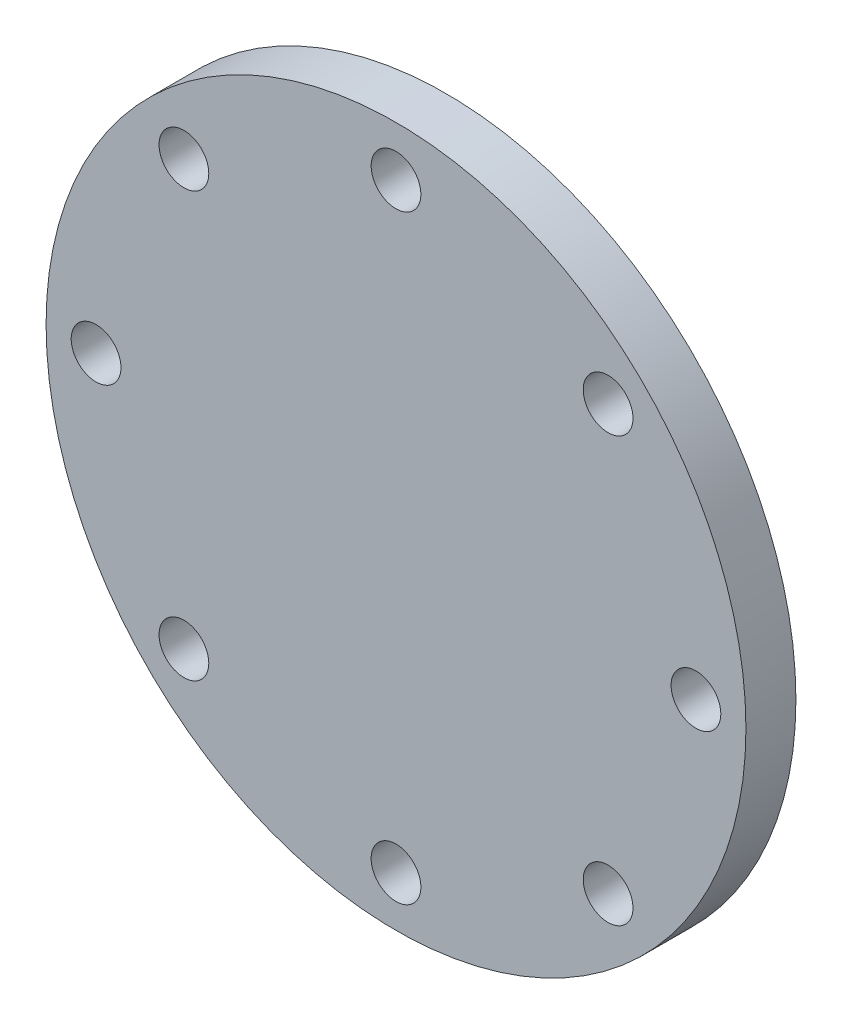
ISO-10303-21;
HEADER;
FILE_DESCRIPTION(('STEP AP214'),'2;1');
FILE_NAME('part.step','',(''),(''),'','','');
FILE_SCHEMA(('AUTOMOTIVE_DESIGN { 1 0 10303 214 1 1 1 1 }'));
ENDSEC;
DATA;
#1=APPLICATION_CONTEXT('core data for automotive mechanical design processes');
#2=APPLICATION_PROTOCOL_DEFINITION('international standard','automotive_design',2000,#1);
#3=PRODUCT_CONTEXT('',#1,'mechanical');
#4=PRODUCT('Part','Part','',(#3));
#5=PRODUCT_RELATED_PRODUCT_CATEGORY('part','',(#4));
#6=PRODUCT_DEFINITION_FORMATION('','',#4);
#7=PRODUCT_DEFINITION_CONTEXT('part definition',#1,'design');
#8=PRODUCT_DEFINITION('design','',#6,#7);
#9=PRODUCT_DEFINITION_SHAPE('','',#8);
#10=(LENGTH_UNIT() NAMED_UNIT(*) SI_UNIT(.MILLI.,.METRE.));
#11=(NAMED_UNIT(*) PLANE_ANGLE_UNIT() SI_UNIT($,.RADIAN.));
#12=(NAMED_UNIT(*) SI_UNIT($,.STERADIAN.) SOLID_ANGLE_UNIT());
#13=UNCERTAINTY_MEASURE_WITH_UNIT(LENGTH_MEASURE(1.E-05),#10,'distance_accuracy_value','');
#14=(GEOMETRIC_REPRESENTATION_CONTEXT(3) GLOBAL_UNCERTAINTY_ASSIGNED_CONTEXT((#13)) GLOBAL_UNIT_ASSIGNED_CONTEXT((#10,
#11,#12)) REPRESENTATION_CONTEXT('',''));
#15=CARTESIAN_POINT('',(0.,0.,0.));
#16=DIRECTION('',(0.,0.,1.));
#17=DIRECTION('',(1.,0.,0.));
#18=AXIS2_PLACEMENT_3D('',#15,#16,#17);
#19=CARTESIAN_POINT('',(0.,0.,0.));
#20=DIRECTION('',(0.,0.,1.));
#21=DIRECTION('',(1.,0.,0.));
#22=AXIS2_PLACEMENT_3D('',#19,#20,#21);
#23=PLANE('',#22);
#24=CARTESIAN_POINT('',(0.,0.,0.));
#25=DIRECTION('',(0.,0.,1.));
#26=DIRECTION('',(1.,0.,0.));
#27=AXIS2_PLACEMENT_3D('',#24,#25,#26);
#28=CIRCLE('',#27,17.78);
#29=CARTESIAN_POINT('',(17.78,0.,0.));
#30=VERTEX_POINT('',#29);
#31=EDGE_CURVE('E42',#30,#30,#28,.T.);
#32=ORIENTED_EDGE('',*,*,#31,.F.);
#33=EDGE_LOOP('',(#32));
#34=FACE_BOUND('',#33,.T.);
#35=CARTESIAN_POINT('',(0.,15.24,0.));
#36=DIRECTION('',(0.,0.,1.));
#37=DIRECTION('',(1.,0.,0.));
#38=AXIS2_PLACEMENT_3D('',#35,#36,#37);
#39=CIRCLE('',#38,1.26364999999999);
#40=CARTESIAN_POINT('',(1.26364999999999,15.24,0.));
#41=VERTEX_POINT('',#40);
#42=EDGE_CURVE('E47',#41,#41,#39,.T.);
#43=ORIENTED_EDGE('',*,*,#42,.T.);
#44=EDGE_LOOP('',(#43));
#45=FACE_BOUND('',#44,.T.);
#46=CARTESIAN_POINT('',(-10.776307345283,10.776307345283,0.));
#47=DIRECTION('',(0.,0.,1.));
#48=DIRECTION('',(1.,0.,0.));
#49=AXIS2_PLACEMENT_3D('',#46,#47,#48);
#50=CIRCLE('',#49,1.26364999999999);
#51=CARTESIAN_POINT('',(-9.51265734528302,10.776307345283,0.));
#52=VERTEX_POINT('',#51);
#53=EDGE_CURVE('E52',#52,#52,#50,.T.);
#54=ORIENTED_EDGE('',*,*,#53,.T.);
#55=EDGE_LOOP('',(#54));
#56=FACE_BOUND('',#55,.T.);
#57=CARTESIAN_POINT('',(-15.24,0.,0.));
#58=DIRECTION('',(0.,0.,1.));
#59=DIRECTION('',(1.,0.,0.));
#60=AXIS2_PLACEMENT_3D('',#57,#58,#59);
#61=CIRCLE('',#60,1.26364999999999);
#62=CARTESIAN_POINT('',(-13.97635,0.,0.));
#63=VERTEX_POINT('',#62);
#64=EDGE_CURVE('E96',#63,#63,#61,.T.);
#65=ORIENTED_EDGE('',*,*,#64,.T.);
#66=EDGE_LOOP('',(#65));
#67=FACE_BOUND('',#66,.T.);
#68=CARTESIAN_POINT('',(-10.7763073452829,-10.776307345283,0.));
#69=DIRECTION('',(0.,0.,1.));
#70=DIRECTION('',(1.,0.,0.));
#71=AXIS2_PLACEMENT_3D('',#68,#69,#70);
#72=CIRCLE('',#71,1.26364999999999);
#73=CARTESIAN_POINT('',(-9.51265734528294,-10.776307345283,0.));
#74=VERTEX_POINT('',#73);
#75=EDGE_CURVE('E57',#74,#74,#72,.T.);
#76=ORIENTED_EDGE('',*,*,#75,.T.);
#77=EDGE_LOOP('',(#76));
#78=FACE_BOUND('',#77,.T.);
#79=CARTESIAN_POINT('',(1.05798292272647E-13,-15.24,0.));
#80=DIRECTION('',(0.,0.,1.));
#81=DIRECTION('',(1.,0.,0.));
#82=AXIS2_PLACEMENT_3D('',#79,#80,#81);
#83=CIRCLE('',#82,1.26364999999999);
#84=CARTESIAN_POINT('',(1.26365000000009,-15.24,0.));
#85=VERTEX_POINT('',#84);
#86=EDGE_CURVE('E62',#85,#85,#83,.T.);
#87=ORIENTED_EDGE('',*,*,#86,.T.);
#88=EDGE_LOOP('',(#87));
#89=FACE_BOUND('',#88,.T.);
#90=CARTESIAN_POINT('',(10.7763073452831,-10.7763073452829,0.));
#91=DIRECTION('',(0.,0.,1.));
#92=DIRECTION('',(1.,0.,0.));
#93=AXIS2_PLACEMENT_3D('',#90,#91,#92);
#94=CIRCLE('',#93,1.26364999999999);
#95=CARTESIAN_POINT('',(12.0399573452831,-10.7763073452829,0.));
#96=VERTEX_POINT('',#95);
#97=EDGE_CURVE('E66',#96,#96,#94,.T.);
#98=ORIENTED_EDGE('',*,*,#97,.T.);
#99=EDGE_LOOP('',(#98));
#100=FACE_BOUND('',#99,.T.);
#101=CARTESIAN_POINT('',(15.24,1.59008498695954E-13,0.));
#102=DIRECTION('',(0.,0.,1.));
#103=DIRECTION('',(1.,0.,0.));
#104=AXIS2_PLACEMENT_3D('',#101,#102,#103);
#105=CIRCLE('',#104,1.26364999999999);
#106=CARTESIAN_POINT('',(16.50365,1.59008498695954E-13,0.));
#107=VERTEX_POINT('',#106);
#108=EDGE_CURVE('E70',#107,#107,#105,.T.);
#109=ORIENTED_EDGE('',*,*,#108,.T.);
#110=EDGE_LOOP('',(#109));
#111=FACE_BOUND('',#110,.T.);
#112=CARTESIAN_POINT('',(10.7763073452829,10.7763073452831,0.));
#113=DIRECTION('',(0.,0.,1.));
#114=DIRECTION('',(1.,0.,0.));
#115=AXIS2_PLACEMENT_3D('',#112,#113,#114);
#116=CIRCLE('',#115,1.26364999999999);
#117=CARTESIAN_POINT('',(12.0399573452828,10.7763073452831,0.));
#118=VERTEX_POINT('',#117);
#119=EDGE_CURVE('E73',#118,#118,#116,.T.);
#120=ORIENTED_EDGE('',*,*,#119,.T.);
#121=EDGE_LOOP('',(#120));
#122=FACE_BOUND('',#121,.T.);
#123=CARTESIAN_POINT('',(0.,0.,0.));
#124=DIRECTION('',(0.,0.,1.));
#125=DIRECTION('',(1.,0.,0.));
#126=AXIS2_PLACEMENT_3D('',#123,#124,#125);
#127=CIRCLE('',#126,3.175);
#128=CARTESIAN_POINT('',(3.175,0.,0.));
#129=VERTEX_POINT('',#128);
#130=EDGE_CURVE('E10',#129,#129,#127,.F.);
#131=ORIENTED_EDGE('',*,*,#130,.F.);
#132=EDGE_LOOP('',(#131));
#133=FACE_BOUND('',#132,.T.);
#134=ADVANCED_FACE('F31',(#34,#45,#56,#67,#78,#89,#100,#111,#122,#133),#23,.F.);
#135=CARTESIAN_POINT('',(0.,0.,2.54));
#136=DIRECTION('',(0.,0.,-1.));
#137=DIRECTION('',(-1.,0.,0.));
#138=AXIS2_PLACEMENT_3D('',#135,#136,#137);
#139=CYLINDRICAL_SURFACE('',#138,17.78);
#140=CARTESIAN_POINT('',(0.,0.,2.54));
#141=DIRECTION('',(0.,0.,1.));
#142=DIRECTION('',(1.,0.,0.));
#143=AXIS2_PLACEMENT_3D('',#140,#141,#142);
#144=CIRCLE('',#143,17.78);
#145=CARTESIAN_POINT('',(17.78,0.,2.54));
#146=VERTEX_POINT('',#145);
#147=EDGE_CURVE('E38',#146,#146,#144,.T.);
#148=ORIENTED_EDGE('',*,*,#147,.F.);
#149=EDGE_LOOP('',(#148));
#150=FACE_BOUND('',#149,.T.);
#151=ORIENTED_EDGE('',*,*,#31,.T.);
#152=EDGE_LOOP('',(#151));
#153=FACE_BOUND('',#152,.T.);
#154=ADVANCED_FACE('F33',(#150,#153),#139,.T.);
#155=CARTESIAN_POINT('',(0.,0.,2.54));
#156=DIRECTION('',(0.,0.,1.));
#157=DIRECTION('',(1.,0.,0.));
#158=AXIS2_PLACEMENT_3D('',#155,#156,#157);
#159=PLANE('',#158);
#160=CARTESIAN_POINT('',(10.7763073452829,10.7763073452831,2.54));
#161=DIRECTION('',(0.,0.,1.));
#162=DIRECTION('',(1.,0.,0.));
#163=AXIS2_PLACEMENT_3D('',#160,#161,#162);
#164=CIRCLE('',#163,1.26364999999999);
#165=CARTESIAN_POINT('',(12.0399573452828,10.7763073452831,2.54));
#166=VERTEX_POINT('',#165);
#167=EDGE_CURVE('E75',#166,#166,#164,.T.);
#168=ORIENTED_EDGE('',*,*,#167,.F.);
#169=EDGE_LOOP('',(#168));
#170=FACE_BOUND('',#169,.T.);
#171=CARTESIAN_POINT('',(15.24,1.59008498695954E-13,2.54));
#172=DIRECTION('',(0.,0.,1.));
#173=DIRECTION('',(1.,0.,0.));
#174=AXIS2_PLACEMENT_3D('',#171,#172,#173);
#175=CIRCLE('',#174,1.26364999999999);
#176=CARTESIAN_POINT('',(16.50365,1.59008498695954E-13,2.54));
#177=VERTEX_POINT('',#176);
#178=EDGE_CURVE('E72',#177,#177,#175,.T.);
#179=ORIENTED_EDGE('',*,*,#178,.F.);
#180=EDGE_LOOP('',(#179));
#181=FACE_BOUND('',#180,.T.);
#182=CARTESIAN_POINT('',(10.7763073452831,-10.7763073452829,2.54));
#183=DIRECTION('',(0.,0.,1.));
#184=DIRECTION('',(1.,0.,0.));
#185=AXIS2_PLACEMENT_3D('',#182,#183,#184);
#186=CIRCLE('',#185,1.26364999999999);
#187=CARTESIAN_POINT('',(12.0399573452831,-10.7763073452829,2.54));
#188=VERTEX_POINT('',#187);
#189=EDGE_CURVE('E69',#188,#188,#186,.T.);
#190=ORIENTED_EDGE('',*,*,#189,.F.);
#191=EDGE_LOOP('',(#190));
#192=FACE_BOUND('',#191,.T.);
#193=CARTESIAN_POINT('',(1.05798292272647E-13,-15.24,2.54));
#194=DIRECTION('',(0.,0.,1.));
#195=DIRECTION('',(1.,0.,0.));
#196=AXIS2_PLACEMENT_3D('',#193,#194,#195);
#197=CIRCLE('',#196,1.26364999999999);
#198=CARTESIAN_POINT('',(1.2636500000001,-15.24,2.54));
#199=VERTEX_POINT('',#198);
#200=EDGE_CURVE('E65',#199,#199,#197,.T.);
#201=ORIENTED_EDGE('',*,*,#200,.F.);
#202=EDGE_LOOP('',(#201));
#203=FACE_BOUND('',#202,.T.);
#204=CARTESIAN_POINT('',(-10.7763073452829,-10.776307345283,2.54));
#205=DIRECTION('',(0.,0.,1.));
#206=DIRECTION('',(1.,0.,0.));
#207=AXIS2_PLACEMENT_3D('',#204,#205,#206);
#208=CIRCLE('',#207,1.26364999999999);
#209=CARTESIAN_POINT('',(-9.51265734528294,-10.776307345283,2.54));
#210=VERTEX_POINT('',#209);
#211=EDGE_CURVE('E61',#210,#210,#208,.T.);
#212=ORIENTED_EDGE('',*,*,#211,.F.);
#213=EDGE_LOOP('',(#212));
#214=FACE_BOUND('',#213,.T.);
#215=CARTESIAN_POINT('',(-15.24,0.,2.54));
#216=DIRECTION('',(0.,0.,1.));
#217=DIRECTION('',(1.,0.,0.));
#218=AXIS2_PLACEMENT_3D('',#215,#216,#217);
#219=CIRCLE('',#218,1.26364999999999);
#220=CARTESIAN_POINT('',(-13.97635,0.,2.54));
#221=VERTEX_POINT('',#220);
#222=EDGE_CURVE('E60',#221,#221,#219,.T.);
#223=ORIENTED_EDGE('',*,*,#222,.F.);
#224=EDGE_LOOP('',(#223));
#225=FACE_BOUND('',#224,.T.);
#226=CARTESIAN_POINT('',(-10.776307345283,10.776307345283,2.54));
#227=DIRECTION('',(0.,0.,1.));
#228=DIRECTION('',(1.,0.,0.));
#229=AXIS2_PLACEMENT_3D('',#226,#227,#228);
#230=CIRCLE('',#229,1.26364999999999);
#231=CARTESIAN_POINT('',(-9.51265734528302,10.776307345283,2.54));
#232=VERTEX_POINT('',#231);
#233=EDGE_CURVE('E56',#232,#232,#230,.T.);
#234=ORIENTED_EDGE('',*,*,#233,.F.);
#235=EDGE_LOOP('',(#234));
#236=FACE_BOUND('',#235,.T.);
#237=CARTESIAN_POINT('',(0.,15.24,2.54));
#238=DIRECTION('',(0.,0.,1.));
#239=DIRECTION('',(1.,0.,0.));
#240=AXIS2_PLACEMENT_3D('',#237,#238,#239);
#241=CIRCLE('',#240,1.26364999999999);
#242=CARTESIAN_POINT('',(1.26364999999999,15.24,2.54));
#243=VERTEX_POINT('',#242);
#244=EDGE_CURVE('E55',#243,#243,#241,.T.);
#245=ORIENTED_EDGE('',*,*,#244,.F.);
#246=EDGE_LOOP('',(#245));
#247=FACE_BOUND('',#246,.T.);
#248=ORIENTED_EDGE('',*,*,#147,.T.);
#249=EDGE_LOOP('',(#248));
#250=FACE_BOUND('',#249,.T.);
#251=ADVANCED_FACE('F111',(#170,#181,#192,#203,#214,#225,#236,#247,#250),#159,.T.);
#252=CARTESIAN_POINT('',(0.,15.24,2.54));
#253=DIRECTION('',(0.,0.,1.));
#254=DIRECTION('',(1.,0.,0.));
#255=AXIS2_PLACEMENT_3D('',#252,#253,#254);
#256=CYLINDRICAL_SURFACE('',#255,1.26364999999999);
#257=ORIENTED_EDGE('',*,*,#244,.T.);
#258=EDGE_LOOP('',(#257));
#259=FACE_BOUND('',#258,.T.);
#260=ORIENTED_EDGE('',*,*,#42,.F.);
#261=EDGE_LOOP('',(#260));
#262=FACE_BOUND('',#261,.T.);
#263=ADVANCED_FACE('F108',(#259,#262),#256,.F.);
#264=CARTESIAN_POINT('',(-10.776307345283,10.776307345283,2.54));
#265=DIRECTION('',(0.,0.,1.));
#266=DIRECTION('',(1.,0.,0.));
#267=AXIS2_PLACEMENT_3D('',#264,#265,#266);
#268=CYLINDRICAL_SURFACE('',#267,1.26364999999999);
#269=ORIENTED_EDGE('',*,*,#233,.T.);
#270=EDGE_LOOP('',(#269));
#271=FACE_BOUND('',#270,.T.);
#272=ORIENTED_EDGE('',*,*,#53,.F.);
#273=EDGE_LOOP('',(#272));
#274=FACE_BOUND('',#273,.T.);
#275=ADVANCED_FACE('F110',(#271,#274),#268,.F.);
#276=CARTESIAN_POINT('',(-15.24,0.,2.54));
#277=DIRECTION('',(0.,0.,1.));
#278=DIRECTION('',(1.,0.,0.));
#279=AXIS2_PLACEMENT_3D('',#276,#277,#278);
#280=CYLINDRICAL_SURFACE('',#279,1.26364999999999);
#281=ORIENTED_EDGE('',*,*,#222,.T.);
#282=EDGE_LOOP('',(#281));
#283=FACE_BOUND('',#282,.T.);
#284=ORIENTED_EDGE('',*,*,#64,.F.);
#285=EDGE_LOOP('',(#284));
#286=FACE_BOUND('',#285,.T.);
#287=ADVANCED_FACE('F117',(#283,#286),#280,.F.);
#288=CARTESIAN_POINT('',(-10.7763073452829,-10.776307345283,2.54));
#289=DIRECTION('',(0.,0.,1.));
#290=DIRECTION('',(1.,0.,0.));
#291=AXIS2_PLACEMENT_3D('',#288,#289,#290);
#292=CYLINDRICAL_SURFACE('',#291,1.26364999999999);
#293=ORIENTED_EDGE('',*,*,#211,.T.);
#294=EDGE_LOOP('',(#293));
#295=FACE_BOUND('',#294,.T.);
#296=ORIENTED_EDGE('',*,*,#75,.F.);
#297=EDGE_LOOP('',(#296));
#298=FACE_BOUND('',#297,.T.);
#299=ADVANCED_FACE('F153',(#295,#298),#292,.F.);
#300=CARTESIAN_POINT('',(1.05798292272647E-13,-15.24,2.54));
#301=DIRECTION('',(0.,0.,1.));
#302=DIRECTION('',(1.,0.,0.));
#303=AXIS2_PLACEMENT_3D('',#300,#301,#302);
#304=CYLINDRICAL_SURFACE('',#303,1.26364999999999);
#305=ORIENTED_EDGE('',*,*,#200,.T.);
#306=EDGE_LOOP('',(#305));
#307=FACE_BOUND('',#306,.T.);
#308=ORIENTED_EDGE('',*,*,#86,.F.);
#309=EDGE_LOOP('',(#308));
#310=FACE_BOUND('',#309,.T.);
#311=ADVANCED_FACE('F163',(#307,#310),#304,.F.);
#312=CARTESIAN_POINT('',(10.7763073452831,-10.7763073452829,2.54));
#313=DIRECTION('',(0.,0.,1.));
#314=DIRECTION('',(1.,0.,0.));
#315=AXIS2_PLACEMENT_3D('',#312,#313,#314);
#316=CYLINDRICAL_SURFACE('',#315,1.26364999999999);
#317=ORIENTED_EDGE('',*,*,#189,.T.);
#318=EDGE_LOOP('',(#317));
#319=FACE_BOUND('',#318,.T.);
#320=ORIENTED_EDGE('',*,*,#97,.F.);
#321=EDGE_LOOP('',(#320));
#322=FACE_BOUND('',#321,.T.);
#323=ADVANCED_FACE('F173',(#319,#322),#316,.F.);
#324=CARTESIAN_POINT('',(15.24,1.59008498695954E-13,2.54));
#325=DIRECTION('',(0.,0.,1.));
#326=DIRECTION('',(1.,0.,0.));
#327=AXIS2_PLACEMENT_3D('',#324,#325,#326);
#328=CYLINDRICAL_SURFACE('',#327,1.26364999999999);
#329=ORIENTED_EDGE('',*,*,#178,.T.);
#330=EDGE_LOOP('',(#329));
#331=FACE_BOUND('',#330,.T.);
#332=ORIENTED_EDGE('',*,*,#108,.F.);
#333=EDGE_LOOP('',(#332));
#334=FACE_BOUND('',#333,.T.);
#335=ADVANCED_FACE('F183',(#331,#334),#328,.F.);
#336=CARTESIAN_POINT('',(10.7763073452829,10.7763073452831,2.54));
#337=DIRECTION('',(0.,0.,1.));
#338=DIRECTION('',(1.,0.,0.));
#339=AXIS2_PLACEMENT_3D('',#336,#337,#338);
#340=CYLINDRICAL_SURFACE('',#339,1.26364999999999);
#341=ORIENTED_EDGE('',*,*,#167,.T.);
#342=EDGE_LOOP('',(#341));
#343=FACE_BOUND('',#342,.T.);
#344=ORIENTED_EDGE('',*,*,#119,.F.);
#345=EDGE_LOOP('',(#344));
#346=FACE_BOUND('',#345,.T.);
#347=ADVANCED_FACE('F193',(#343,#346),#340,.F.);
#348=CARTESIAN_POINT('',(0.,0.,-2.54));
#349=DIRECTION('',(0.,0.,1.));
#350=DIRECTION('',(1.,0.,0.));
#351=AXIS2_PLACEMENT_3D('',#348,#349,#350);
#352=CYLINDRICAL_SURFACE('',#351,3.175);
#353=CARTESIAN_POINT('',(0.,0.,-2.54));
#354=DIRECTION('',(0.,0.,-1.));
#355=DIRECTION('',(-1.,0.,0.));
#356=AXIS2_PLACEMENT_3D('',#353,#354,#355);
#357=CIRCLE('',#356,3.175);
#358=CARTESIAN_POINT('',(-3.175,0.,-2.54));
#359=VERTEX_POINT('',#358);
#360=EDGE_CURVE('E81',#359,#359,#357,.T.);
#361=ORIENTED_EDGE('',*,*,#360,.F.);
#362=EDGE_LOOP('',(#361));
#363=FACE_BOUND('',#362,.T.);
#364=ORIENTED_EDGE('',*,*,#130,.T.);
#365=EDGE_LOOP('',(#364));
#366=FACE_BOUND('',#365,.T.);
#367=ADVANCED_FACE('F202',(#363,#366),#352,.T.);
#368=CARTESIAN_POINT('',(0.,0.,-2.54));
#369=DIRECTION('',(0.,0.,-1.));
#370=DIRECTION('',(-1.,0.,0.));
#371=AXIS2_PLACEMENT_3D('',#368,#369,#370);
#372=PLANE('',#371);
#373=ORIENTED_EDGE('',*,*,#360,.T.);
#374=EDGE_LOOP('',(#373));
#375=FACE_BOUND('',#374,.T.);
#376=ADVANCED_FACE('F216',(#375),#372,.T.);
#377=CLOSED_SHELL('',(#134,#154,#251,#263,#275,#287,#299,#311,#323,#335,#347,#367,#376));
#378=MANIFOLD_SOLID_BREP('B2',#377);
#379=ADVANCED_BREP_SHAPE_REPRESENTATION('',(#18,#378),#14);
#380=SHAPE_DEFINITION_REPRESENTATION(#9,#379);
ENDSEC;
END-ISO-10303-21;
